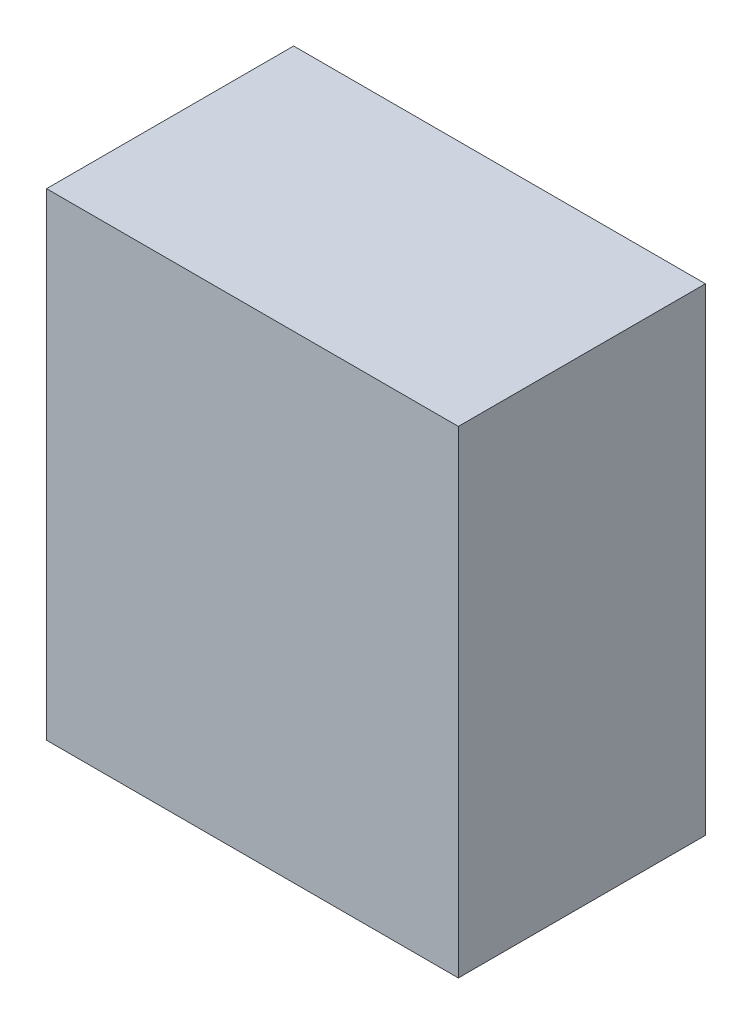
ISO-10303-21;
HEADER;
FILE_DESCRIPTION(('STEP AP214'),'2;1');
FILE_NAME('part.step','',(''),(''),'','','');
FILE_SCHEMA(('AUTOMOTIVE_DESIGN { 1 0 10303 214 1 1 1 1 }'));
ENDSEC;
DATA;
#1=APPLICATION_CONTEXT('core data for automotive mechanical design processes');
#2=APPLICATION_PROTOCOL_DEFINITION('international standard','automotive_design',2000,#1);
#3=PRODUCT_CONTEXT('',#1,'mechanical');
#4=PRODUCT('Part','Part','',(#3));
#5=PRODUCT_RELATED_PRODUCT_CATEGORY('part','',(#4));
#6=PRODUCT_DEFINITION_FORMATION('','',#4);
#7=PRODUCT_DEFINITION_CONTEXT('part definition',#1,'design');
#8=PRODUCT_DEFINITION('design','',#6,#7);
#9=PRODUCT_DEFINITION_SHAPE('','',#8);
#10=(LENGTH_UNIT() NAMED_UNIT(*) SI_UNIT(.MILLI.,.METRE.));
#11=(NAMED_UNIT(*) PLANE_ANGLE_UNIT() SI_UNIT($,.RADIAN.));
#12=(NAMED_UNIT(*) SI_UNIT($,.STERADIAN.) SOLID_ANGLE_UNIT());
#13=UNCERTAINTY_MEASURE_WITH_UNIT(LENGTH_MEASURE(1.E-05),#10,'distance_accuracy_value','');
#14=(GEOMETRIC_REPRESENTATION_CONTEXT(3) GLOBAL_UNCERTAINTY_ASSIGNED_CONTEXT((#13)) GLOBAL_UNIT_ASSIGNED_CONTEXT((#10,
#11,#12)) REPRESENTATION_CONTEXT('',''));
#15=CARTESIAN_POINT('',(0.,0.,0.));
#16=DIRECTION('',(0.,0.,1.));
#17=DIRECTION('',(1.,0.,0.));
#18=AXIS2_PLACEMENT_3D('',#15,#16,#17);
#19=CARTESIAN_POINT('',(5.,11.6,3.));
#20=DIRECTION('',(-1.,0.,0.));
#21=DIRECTION('',(0.,0.,1.));
#22=AXIS2_PLACEMENT_3D('',#19,#20,#21);
#23=PLANE('',#22);
#24=DIRECTION('',(0.,0.,-1.));
#25=VECTOR('',#24,1.);
#26=CARTESIAN_POINT('',(5.,0.,3.));
#27=LINE('',#26,#25);
#28=CARTESIAN_POINT('',(5.,0.,3.));
#29=VERTEX_POINT('',#28);
#30=CARTESIAN_POINT('',(5.,0.,-3.));
#31=VERTEX_POINT('',#30);
#32=EDGE_CURVE('E95',#29,#31,#27,.T.);
#33=ORIENTED_EDGE('',*,*,#32,.T.);
#34=DIRECTION('',(0.,-1.,0.));
#35=VECTOR('',#34,1.);
#36=CARTESIAN_POINT('',(5.,11.6,-3.));
#37=LINE('',#36,#35);
#38=CARTESIAN_POINT('',(5.,11.6,-3.));
#39=VERTEX_POINT('',#38);
#40=EDGE_CURVE('E11',#39,#31,#37,.T.);
#41=ORIENTED_EDGE('',*,*,#40,.F.);
#42=DIRECTION('',(0.,0.,-1.));
#43=VECTOR('',#42,1.);
#44=CARTESIAN_POINT('',(5.,11.6,3.));
#45=LINE('',#44,#43);
#46=CARTESIAN_POINT('',(5.,11.6,3.));
#47=VERTEX_POINT('',#46);
#48=EDGE_CURVE('E83',#47,#39,#45,.T.);
#49=ORIENTED_EDGE('',*,*,#48,.F.);
#50=DIRECTION('',(0.,-1.,0.));
#51=VECTOR('',#50,1.);
#52=CARTESIAN_POINT('',(5.,11.6,3.));
#53=LINE('',#52,#51);
#54=EDGE_CURVE('E91',#47,#29,#53,.T.);
#55=ORIENTED_EDGE('',*,*,#54,.T.);
#56=EDGE_LOOP('',(#33,#41,#49,#55));
#57=FACE_BOUND('',#56,.T.);
#58=ADVANCED_FACE('F32',(#57),#23,.F.);
#59=CARTESIAN_POINT('',(-5.,11.6,-3.));
#60=DIRECTION('',(0.,0.,1.));
#61=DIRECTION('',(1.,0.,0.));
#62=AXIS2_PLACEMENT_3D('',#59,#60,#61);
#63=PLANE('',#62);
#64=DIRECTION('',(-1.,0.,0.));
#65=VECTOR('',#64,1.);
#66=CARTESIAN_POINT('',(-5.,0.,-3.));
#67=LINE('',#66,#65);
#68=CARTESIAN_POINT('',(-5.,0.,-3.));
#69=VERTEX_POINT('',#68);
#70=EDGE_CURVE('E87',#31,#69,#67,.T.);
#71=ORIENTED_EDGE('',*,*,#70,.T.);
#72=DIRECTION('',(0.,-1.,0.));
#73=VECTOR('',#72,1.);
#74=CARTESIAN_POINT('',(-5.,11.6,-3.));
#75=LINE('',#74,#73);
#76=CARTESIAN_POINT('',(-5.,11.6,-3.));
#77=VERTEX_POINT('',#76);
#78=EDGE_CURVE('E40',#77,#69,#75,.T.);
#79=ORIENTED_EDGE('',*,*,#78,.F.);
#80=DIRECTION('',(-1.,0.,0.));
#81=VECTOR('',#80,1.);
#82=CARTESIAN_POINT('',(-5.,11.6,-3.));
#83=LINE('',#82,#81);
#84=EDGE_CURVE('E78',#39,#77,#83,.T.);
#85=ORIENTED_EDGE('',*,*,#84,.F.);
#86=ORIENTED_EDGE('',*,*,#40,.T.);
#87=EDGE_LOOP('',(#71,#79,#85,#86));
#88=FACE_BOUND('',#87,.T.);
#89=ADVANCED_FACE('F86',(#88),#63,.F.);
#90=CARTESIAN_POINT('',(-5.,11.6,3.));
#91=DIRECTION('',(1.,0.,0.));
#92=DIRECTION('',(0.,0.,-1.));
#93=AXIS2_PLACEMENT_3D('',#90,#91,#92);
#94=PLANE('',#93);
#95=DIRECTION('',(0.,0.,1.));
#96=VECTOR('',#95,1.);
#97=CARTESIAN_POINT('',(-5.,0.,3.));
#98=LINE('',#97,#96);
#99=CARTESIAN_POINT('',(-5.,0.,3.));
#100=VERTEX_POINT('',#99);
#101=EDGE_CURVE('E65',#69,#100,#98,.T.);
#102=ORIENTED_EDGE('',*,*,#101,.T.);
#103=DIRECTION('',(0.,-1.,0.));
#104=VECTOR('',#103,1.);
#105=CARTESIAN_POINT('',(-5.,11.6,3.));
#106=LINE('',#105,#104);
#107=CARTESIAN_POINT('',(-5.,11.6,3.));
#108=VERTEX_POINT('',#107);
#109=EDGE_CURVE('E88',#108,#100,#106,.T.);
#110=ORIENTED_EDGE('',*,*,#109,.F.);
#111=DIRECTION('',(0.,0.,1.));
#112=VECTOR('',#111,1.);
#113=CARTESIAN_POINT('',(-5.,11.6,3.));
#114=LINE('',#113,#112);
#115=EDGE_CURVE('E81',#77,#108,#114,.T.);
#116=ORIENTED_EDGE('',*,*,#115,.F.);
#117=ORIENTED_EDGE('',*,*,#78,.T.);
#118=EDGE_LOOP('',(#102,#110,#116,#117));
#119=FACE_BOUND('',#118,.T.);
#120=ADVANCED_FACE('F89',(#119),#94,.F.);
#121=CARTESIAN_POINT('',(-5.,11.6,3.));
#122=DIRECTION('',(0.,0.,-1.));
#123=DIRECTION('',(-1.,0.,0.));
#124=AXIS2_PLACEMENT_3D('',#121,#122,#123);
#125=PLANE('',#124);
#126=DIRECTION('',(1.,0.,0.));
#127=VECTOR('',#126,1.);
#128=CARTESIAN_POINT('',(-5.,0.,3.));
#129=LINE('',#128,#127);
#130=EDGE_CURVE('E71',#100,#29,#129,.T.);
#131=ORIENTED_EDGE('',*,*,#130,.T.);
#132=ORIENTED_EDGE('',*,*,#54,.F.);
#133=DIRECTION('',(1.,0.,0.));
#134=VECTOR('',#133,1.);
#135=CARTESIAN_POINT('',(-5.,11.6,3.));
#136=LINE('',#135,#134);
#137=EDGE_CURVE('E48',#108,#47,#136,.T.);
#138=ORIENTED_EDGE('',*,*,#137,.F.);
#139=ORIENTED_EDGE('',*,*,#109,.T.);
#140=EDGE_LOOP('',(#131,#132,#138,#139));
#141=FACE_BOUND('',#140,.T.);
#142=ADVANCED_FACE('F102',(#141),#125,.F.);
#143=CARTESIAN_POINT('',(0.,11.6,0.));
#144=DIRECTION('',(0.,-1.,0.));
#145=DIRECTION('',(0.,0.,-1.));
#146=AXIS2_PLACEMENT_3D('',#143,#144,#145);
#147=PLANE('',#146);
#148=ORIENTED_EDGE('',*,*,#48,.T.);
#149=ORIENTED_EDGE('',*,*,#84,.T.);
#150=ORIENTED_EDGE('',*,*,#115,.T.);
#151=ORIENTED_EDGE('',*,*,#137,.T.);
#152=EDGE_LOOP('',(#148,#149,#150,#151));
#153=FACE_BOUND('',#152,.T.);
#154=ADVANCED_FACE('F79',(#153),#147,.F.);
#155=CARTESIAN_POINT('',(0.,0.,0.));
#156=DIRECTION('',(0.,-1.,0.));
#157=DIRECTION('',(0.,0.,-1.));
#158=AXIS2_PLACEMENT_3D('',#155,#156,#157);
#159=PLANE('',#158);
#160=ORIENTED_EDGE('',*,*,#32,.F.);
#161=ORIENTED_EDGE('',*,*,#130,.F.);
#162=ORIENTED_EDGE('',*,*,#101,.F.);
#163=ORIENTED_EDGE('',*,*,#70,.F.);
#164=EDGE_LOOP('',(#160,#161,#162,#163));
#165=FACE_BOUND('',#164,.T.);
#166=ADVANCED_FACE('F105',(#165),#159,.T.);
#167=CLOSED_SHELL('',(#58,#89,#120,#142,#154,#166));
#168=MANIFOLD_SOLID_BREP('B2',#167);
#169=ADVANCED_BREP_SHAPE_REPRESENTATION('',(#18,#168),#14);
#170=SHAPE_DEFINITION_REPRESENTATION(#9,#169);
ENDSEC;
END-ISO-10303-21;
